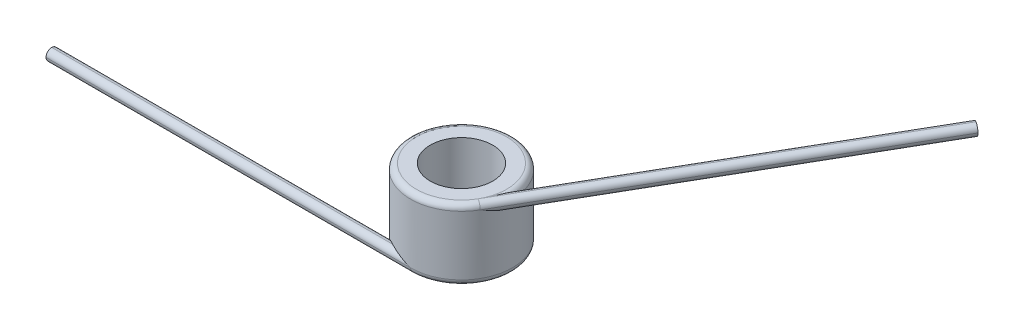
ISO-10303-21;
HEADER;
FILE_DESCRIPTION(('STEP AP214'),'2;1');
FILE_NAME('part.step','',(''),(''),'','','');
FILE_SCHEMA(('AUTOMOTIVE_DESIGN { 1 0 10303 214 1 1 1 1 }'));
ENDSEC;
DATA;
#1=APPLICATION_CONTEXT('core data for automotive mechanical design processes');
#2=APPLICATION_PROTOCOL_DEFINITION('international standard','automotive_design',2000,#1);
#3=PRODUCT_CONTEXT('',#1,'mechanical');
#4=PRODUCT('Part','Part','',(#3));
#5=PRODUCT_RELATED_PRODUCT_CATEGORY('part','',(#4));
#6=PRODUCT_DEFINITION_FORMATION('','',#4);
#7=PRODUCT_DEFINITION_CONTEXT('part definition',#1,'design');
#8=PRODUCT_DEFINITION('design','',#6,#7);
#9=PRODUCT_DEFINITION_SHAPE('','',#8);
#10=(LENGTH_UNIT() NAMED_UNIT(*) SI_UNIT(.MILLI.,.METRE.));
#11=(NAMED_UNIT(*) PLANE_ANGLE_UNIT() SI_UNIT($,.RADIAN.));
#12=(NAMED_UNIT(*) SI_UNIT($,.STERADIAN.) SOLID_ANGLE_UNIT());
#13=UNCERTAINTY_MEASURE_WITH_UNIT(LENGTH_MEASURE(1.E-05),#10,'distance_accuracy_value','');
#14=(GEOMETRIC_REPRESENTATION_CONTEXT(3) GLOBAL_UNCERTAINTY_ASSIGNED_CONTEXT((#13)) GLOBAL_UNIT_ASSIGNED_CONTEXT((#10,
#11,#12)) REPRESENTATION_CONTEXT('',''));
#15=CARTESIAN_POINT('',(0.,0.,0.));
#16=DIRECTION('',(0.,0.,1.));
#17=DIRECTION('',(1.,0.,0.));
#18=AXIS2_PLACEMENT_3D('',#15,#16,#17);
#19=CARTESIAN_POINT('',(0.,9.8806,0.));
#20=DIRECTION('',(0.,-1.,0.));
#21=DIRECTION('',(0.,0.,-1.));
#22=AXIS2_PLACEMENT_3D('',#19,#20,#21);
#23=CYLINDRICAL_SURFACE('',#22,7.112);
#24=CARTESIAN_POINT('',(0.,0.8001,0.));
#25=DIRECTION('',(0.,1.,0.));
#26=DIRECTION('',(0.,0.,1.));
#27=AXIS2_PLACEMENT_3D('',#24,#25,#26);
#28=CIRCLE('',#27,7.112);
#29=CARTESIAN_POINT('',(0.,0.8001,7.112));
#30=VERTEX_POINT('',#29);
#31=CARTESIAN_POINT('',(-4.49450828901227,0.8001,5.5118));
#32=VERTEX_POINT('',#31);
#33=EDGE_CURVE('E235',#30,#32,#28,.T.);
#34=ORIENTED_EDGE('',*,*,#33,.T.);
#35=CARTESIAN_POINT('',(-4.49450828901227,0.8001,5.5118));
#36=CARTESIAN_POINT('',(-4.49451080113085,0.816691575758345,5.51179734371992));
#37=CARTESIAN_POINT('',(-4.49387482832568,0.833272158113652,5.51231659364679));
#38=CARTESIAN_POINT('',(-4.49135592937111,0.866260241989826,5.51436941050985));
#39=CARTESIAN_POINT('',(-4.48947413973823,0.882667887428389,5.51590205296072));
#40=CARTESIAN_POINT('',(-4.48205587736146,0.931106769665993,5.5219345365684));
#41=CARTESIAN_POINT('',(-4.47474504982169,0.96271017843125,5.52787032283946));
#42=CARTESIAN_POINT('',(-4.45596264204576,1.0236437656989,5.5430210661597));
#43=CARTESIAN_POINT('',(-4.44450479750546,1.05298106519207,5.55222519596327));
#44=CARTESIAN_POINT('',(-4.41809894359944,1.10908561625661,5.57326045558614));
#45=CARTESIAN_POINT('',(-4.40314202243917,1.13584605495984,5.58509828934701));
#46=CARTESIAN_POINT('',(-4.36306513018997,1.19794411682731,5.61650291793075));
#47=CARTESIAN_POINT('',(-4.33639871034843,1.23173120947304,5.63715222757647));
#48=CARTESIAN_POINT('',(-4.27886583268416,1.29355698707431,5.6809480055889));
#49=CARTESIAN_POINT('',(-4.24799289138309,1.32158662753007,5.70409831709318));
#50=CARTESIAN_POINT('',(-4.16495159956196,1.38684666894744,5.76520996972485));
#51=CARTESIAN_POINT('',(-4.11059664917026,1.42034446454623,5.80415782657269));
#52=CARTESIAN_POINT('',(-3.99711041635319,1.4772180795716,5.8828975205468));
#53=CARTESIAN_POINT('',(-3.9379532113367,1.50053394202919,5.92269294712346));
#54=CARTESIAN_POINT('',(-3.82944843548134,1.53482372739511,5.99325753988538));
#55=CARTESIAN_POINT('',(-3.78066363030972,1.54736356568082,6.0241600987858));
#56=CARTESIAN_POINT('',(-3.68163912965761,1.56808398029715,6.08518395959253));
#57=CARTESIAN_POINT('',(-3.63139790534969,1.57625978701665,6.11530437261036));
#58=CARTESIAN_POINT('',(-3.53088358686975,1.58876244805383,6.17387384637075));
#59=CARTESIAN_POINT('',(-3.48063194389849,1.59316423705709,6.20234444486787));
#60=CARTESIAN_POINT('',(-3.37944182452965,1.59887132918416,6.25805538206685));
#61=CARTESIAN_POINT('',(-3.32850544406076,1.60018455749448,6.28529869318305));
#62=CARTESIAN_POINT('',(-3.27726446750944,1.6002,6.3119));
#63=B_SPLINE_CURVE_WITH_KNOTS('',3,(#35,#36,#37,#38,#39,#40,#41,#42,#43,#44,#45,#46,#47,#48,#49,
#50,#51,#52,#53,#54,#55,#56,#57,#58,#59,#60,#61,#62),.UNSPECIFIED.,.F.,.F.,(4,2,2,2,2,2,2,2,2,2,
2,2,2,4),(0.,0.0497337481254846,0.0994221882394215,0.197748275093918,0.295751624034279,
0.394007348529555,0.536422810542566,0.679060313182286,0.902181737986767,1.12659987042889,
1.30368265533889,1.48095858631475,1.65462723998905,1.82784977476618),.UNSPECIFIED.);
#64=CARTESIAN_POINT('',(-3.27726446750945,1.6002,6.3119));
#65=VERTEX_POINT('',#64);
#66=EDGE_CURVE('E11',#32,#65,#63,.T.);
#67=ORIENTED_EDGE('',*,*,#66,.T.);
#68=CARTESIAN_POINT('',(-3.27726446750945,1.6002,6.3119));
#69=CARTESIAN_POINT('',(-3.22577319071094,1.60019125878616,6.33863640810558));
#70=CARTESIAN_POINT('',(-3.17397080121037,1.59886105647557,6.3647320916057));
#71=CARTESIAN_POINT('',(-3.06985554330409,1.59386483641482,6.41559687844702));
#72=CARTESIAN_POINT('',(-3.01754290426367,1.59019982449484,6.44036654805308));
#73=CARTESIAN_POINT('',(-2.8601686599478,1.57618127817764,6.51254780297371));
#74=CARTESIAN_POINT('',(-2.75444607475934,1.56280151227291,6.55794815943721));
#75=CARTESIAN_POINT('',(-2.54227229890444,1.52986497624073,6.64307265846747));
#76=CARTESIAN_POINT('',(-2.43582617169205,1.5103349209512,6.68282029059783));
#77=CARTESIAN_POINT('',(-2.22200236123469,1.46640782392042,6.7569270793068));
#78=CARTESIAN_POINT('',(-2.11462408422714,1.44200742296568,6.79128248733932));
#79=CARTESIAN_POINT('',(-1.84276867346074,1.37562928115081,6.87124565452523));
#80=CARTESIAN_POINT('',(-1.67785384252937,1.33114057764134,6.9133170976154));
#81=CARTESIAN_POINT('',(-1.34713711270919,1.2362600005475,6.98530174523664));
#82=CARTESIAN_POINT('',(-1.18133498224518,1.1858665061941,7.0152116014921));
#83=CARTESIAN_POINT('',(-0.682899888290263,1.02913056514713,7.08709086236258));
#84=CARTESIAN_POINT('',(-0.349157968962726,0.91721082325161,7.11123322508794));
#85=CARTESIAN_POINT('',(-0.010660527862127,0.803675627695595,7.11199400277877));
#86=CARTESIAN_POINT('',(-0.00533018613452203,0.801887776192962,7.1119999947834));
#87=CARTESIAN_POINT('',(0.,0.8001,7.112));
#88=B_SPLINE_CURVE_WITH_KNOTS('',3,(#68,#69,#70,#71,#72,#73,#74,#75,#76,#77,#78,#79,#80,#81,#82,
#83,#84,#85,#86,#87),.UNSPECIFIED.,.F.,.F.,(4,2,2,2,2,2,2,2,2,4),(0.,0.174006957486809,
0.347939003854589,0.695046557647333,1.04066671662635,1.38652608839392,1.91360707300454,
2.4408330731805,3.49502816093425,3.51189470542901),.UNSPECIFIED.);
#89=EDGE_CURVE('E42',#65,#30,#88,.T.);
#90=ORIENTED_EDGE('',*,*,#89,.T.);
#91=EDGE_LOOP('',(#34,#67,#90));
#92=FACE_BOUND('',#91,.T.);
#93=CARTESIAN_POINT('',(0.,9.0805,0.));
#94=DIRECTION('',(0.,1.,0.));
#95=DIRECTION('',(0.,0.,1.));
#96=AXIS2_PLACEMENT_3D('',#93,#94,#95);
#97=CIRCLE('',#96,7.112);
#98=CARTESIAN_POINT('',(6.15917267171493,9.0805,3.55599999999999));
#99=VERTEX_POINT('',#98);
#100=CARTESIAN_POINT('',(7.02061296508521,9.0805,-1.13645835580435));
#101=VERTEX_POINT('',#100);
#102=EDGE_CURVE('E251',#99,#101,#97,.F.);
#103=ORIENTED_EDGE('',*,*,#102,.T.);
#104=CARTESIAN_POINT('',(7.02061296508521,9.0805,-1.13645835580435));
#105=CARTESIAN_POINT('',(7.02061192073846,9.06390842424166,-1.1364618595029));
#106=CARTESIAN_POINT('',(7.02074361796347,9.04732784188635,-1.13565146593407));
#107=CARTESIAN_POINT('',(7.0212619600389,9.01433975801018,-1.13244362701832));
#108=CARTESIAN_POINT('',(7.02164837251984,8.99793211257161,-1.13004762816623));
#109=CARTESIAN_POINT('',(7.02316352538362,8.94949323033401,-1.12060698269217));
#110=CARTESIAN_POINT('',(7.0246486533159,8.91788982156875,-1.11130772718451));
#111=CARTESIAN_POINT('',(7.02837837802948,8.85695623430111,-1.0874663132462));
#112=CARTESIAN_POINT('',(7.03062046598896,8.82761893480793,-1.07294146389991));
#113=CARTESIAN_POINT('',(7.03563460824455,8.77151438374339,-1.03955569379724));
#114=CARTESIAN_POINT('',(7.03840801242711,8.74475394504017,-1.02068370322961));
#115=CARTESIAN_POINT('',(7.04556677245244,8.68265588317269,-0.970273782145198));
#116=CARTESIAN_POINT('',(7.05011638925548,8.64886879052697,-0.936855330311583));
#117=CARTESIAN_POINT('',(7.05927820676061,8.58704301292569,-0.865132507695284));
#118=CARTESIAN_POINT('',(7.0638904939783,8.55901337246993,-0.826820600486872));
#119=CARTESIAN_POINT('',(7.07529409171401,8.49375333105256,-0.724348905890859));
#120=CARTESIAN_POINT('',(7.08184644997136,8.46025553545377,-0.657802209606287));
#121=CARTESIAN_POINT('',(7.0932939088306,8.4033819204284,-0.520150402019851));
#122=CARTESIAN_POINT('',(7.09817915669219,8.38006605797081,-0.449021046370356));
#123=CARTESIAN_POINT('',(7.10503749870404,8.34577627260489,-0.319770857666714));
#124=CARTESIAN_POINT('',(7.10740749716794,8.33323643431918,-0.262070697619209));
#125=CARTESIAN_POINT('',(7.11074346053751,8.31251601970285,-0.145801034054047));
#126=CARTESIAN_POINT('',(7.11170789122948,8.30434021298335,-0.0872306509772452));
#127=CARTESIAN_POINT('',(7.11217338415229,8.29183755194617,0.0291020391506583));
#128=CARTESIAN_POINT('',(7.11170382422612,8.28743576294291,0.0868565377942412));
#129=CARTESIAN_POINT('',(7.10935585142464,8.28172867081584,0.202345220379128));
#130=CARTESIAN_POINT('',(7.10748106070003,8.28041544250552,0.260079075400112));
#131=CARTESIAN_POINT('',(7.10489797990172,8.2804,0.317755716216755));
#132=B_SPLINE_CURVE_WITH_KNOTS('',3,(#104,#105,#106,#107,#108,#109,#110,#111,#112,#113,#114,
#115,#116,#117,#118,#119,#120,#121,#122,#123,#124,#125,#126,#127,#128,#129,#130,#131),
.UNSPECIFIED.,.F.,.F.,(4,2,2,2,2,2,2,2,2,2,2,2,2,4),(0.,0.0497337481254836,0.0994221882394212,
0.197748275093917,0.295751624034276,0.394007348529553,0.536422810542564,0.679060313182285,
0.902181737986767,1.12659987042889,1.30368265533889,1.48095858631475,1.65462723998906,
1.82784977476619),.UNSPECIFIED.);
#133=CARTESIAN_POINT('',(7.10489797990172,8.2804,0.317755716216726));
#134=VERTEX_POINT('',#133);
#135=EDGE_CURVE('E56',#101,#134,#132,.T.);
#136=ORIENTED_EDGE('',*,*,#135,.T.);
#137=CARTESIAN_POINT('',(7.10489797990172,8.2804,0.317755716216726));
#138=CARTESIAN_POINT('',(7.10230675012785,8.28040874121383,0.375716674050309));
#139=CARTESIAN_POINT('',(7.09900508021779,8.28173894352443,0.433626701084578));
#140=CARTESIAN_POINT('',(7.09099764882732,8.28673516358517,0.549225552773618));
#141=CARTESIAN_POINT('',(7.0862924924293,8.29040017550516,0.60691446192464));
#142=CARTESIAN_POINT('',(7.07011617070968,8.30441872182235,0.779295182863842));
#143=CARTESIAN_POINT('',(7.05657274015372,8.31779848772708,0.893553805622536));
#144=CARTESIAN_POINT('',(7.0242058308709,8.35073502375925,1.11986393504488));
#145=CARTESIAN_POINT('',(7.00540522642987,8.37026507904878,1.23192280141049));
#146=CARTESIAN_POINT('',(6.96267168281604,8.41419217607957,1.4541530475551));
#147=CARTESIAN_POINT('',(6.9387352004258,8.43859257703432,1.56432306727452));
#148=CARTESIAN_POINT('',(6.87205762919265,8.50497071884918,1.83973834274747));
#149=CARTESIAN_POINT('',(6.82603515221691,8.54945942235861,2.00359449733995));
#150=CARTESIAN_POINT('',(6.7230173208293,8.64433999945256,2.32599591063135));
#151=CARTESIAN_POINT('',(6.66601895093809,8.69473349380609,2.48453969574246));
#152=CARTESIAN_POINT('',(6.47905066987962,8.85146943485252,2.9521367796805));
#153=CARTESIAN_POINT('',(6.33308760964313,8.96338917674642,3.25323694148906));
#154=CARTESIAN_POINT('',(6.16449774190005,9.07692437230435,3.54676471344305));
#155=CARTESIAN_POINT('',(6.16183776026449,9.07871222380701,3.55138392079231));
#156=CARTESIAN_POINT('',(6.15917267171494,9.0805,3.55599999999999));
#157=B_SPLINE_CURVE_WITH_KNOTS('',3,(#137,#138,#139,#140,#141,#142,#143,#144,#145,#146,#147,
#148,#149,#150,#151,#152,#153,#154,#155,#156),.UNSPECIFIED.,.F.,.F.,(4,2,2,2,2,2,2,2,2,4),(0.,
0.174006957486763,0.347939003854497,0.695046557647168,1.04066671662628,1.38652608839392,
1.91360707300456,2.44083307318056,3.49502816093425,3.51189470542901),.UNSPECIFIED.);
#158=EDGE_CURVE('E198',#134,#99,#157,.T.);
#159=ORIENTED_EDGE('',*,*,#158,.T.);
#160=EDGE_LOOP('',(#103,#136,#159));
#161=FACE_BOUND('',#160,.T.);
#162=ADVANCED_FACE('F32',(#92,#161),#23,.T.);
#163=CARTESIAN_POINT('',(0.,9.8806,0.));
#164=DIRECTION('',(0.,1.,0.));
#165=DIRECTION('',(0.,0.,1.));
#166=AXIS2_PLACEMENT_3D('',#163,#164,#165);
#167=PLANE('',#166);
#168=CARTESIAN_POINT('',(0.,9.8806,0.));
#169=DIRECTION('',(0.,1.,0.));
#170=DIRECTION('',(0.,0.,1.));
#171=AXIS2_PLACEMENT_3D('',#168,#169,#170);
#172=CIRCLE('',#171,6.3119);
#173=CARTESIAN_POINT('',(5.46626779756084,9.8806,3.15594644684433));
#174=VERTEX_POINT('',#173);
#175=EDGE_CURVE('E231',#174,#174,#172,.T.);
#176=ORIENTED_EDGE('',*,*,#175,.T.);
#177=EDGE_LOOP('',(#176));
#178=FACE_BOUND('',#177,.T.);
#179=CARTESIAN_POINT('',(0.,9.8806,0.));
#180=DIRECTION('',(0.,1.,0.));
#181=DIRECTION('',(0.,0.,1.));
#182=AXIS2_PLACEMENT_3D('',#179,#180,#181);
#183=CIRCLE('',#182,4.3561);
#184=CARTESIAN_POINT('',(0.,9.8806,4.3561));
#185=VERTEX_POINT('',#184);
#186=EDGE_CURVE('E256',#185,#185,#183,.T.);
#187=ORIENTED_EDGE('',*,*,#186,.F.);
#188=EDGE_LOOP('',(#187));
#189=FACE_BOUND('',#188,.T.);
#190=ADVANCED_FACE('F192',(#178,#189),#167,.T.);
#191=CARTESIAN_POINT('',(0.,0.,0.));
#192=DIRECTION('',(0.,1.,0.));
#193=DIRECTION('',(0.,0.,1.));
#194=AXIS2_PLACEMENT_3D('',#191,#192,#193);
#195=PLANE('',#194);
#196=CARTESIAN_POINT('',(0.,0.,0.));
#197=DIRECTION('',(0.,1.,0.));
#198=DIRECTION('',(0.,0.,1.));
#199=AXIS2_PLACEMENT_3D('',#196,#197,#198);
#200=CIRCLE('',#199,6.3119);
#201=CARTESIAN_POINT('',(-4.11568839592003E-06,0.,6.31189999999866));
#202=VERTEX_POINT('',#201);
#203=EDGE_CURVE('E206',#202,#202,#200,.F.);
#204=ORIENTED_EDGE('',*,*,#203,.T.);
#205=EDGE_LOOP('',(#204));
#206=FACE_BOUND('',#205,.T.);
#207=CARTESIAN_POINT('',(0.,0.,0.));
#208=DIRECTION('',(0.,1.,0.));
#209=DIRECTION('',(0.,0.,1.));
#210=AXIS2_PLACEMENT_3D('',#207,#208,#209);
#211=CIRCLE('',#210,4.3561);
#212=CARTESIAN_POINT('',(0.,0.,4.3561));
#213=VERTEX_POINT('',#212);
#214=EDGE_CURVE('E257',#213,#213,#211,.T.);
#215=ORIENTED_EDGE('',*,*,#214,.T.);
#216=EDGE_LOOP('',(#215));
#217=FACE_BOUND('',#216,.T.);
#218=ADVANCED_FACE('F193',(#206,#217),#195,.F.);
#219=CARTESIAN_POINT('',(0.,9.8806,0.));
#220=DIRECTION('',(0.,-1.,0.));
#221=DIRECTION('',(0.,0.,-1.));
#222=AXIS2_PLACEMENT_3D('',#219,#220,#221);
#223=CYLINDRICAL_SURFACE('',#222,4.3561);
#224=ORIENTED_EDGE('',*,*,#186,.T.);
#225=EDGE_LOOP('',(#224));
#226=FACE_BOUND('',#225,.T.);
#227=ORIENTED_EDGE('',*,*,#214,.F.);
#228=EDGE_LOOP('',(#227));
#229=FACE_BOUND('',#228,.T.);
#230=ADVANCED_FACE('F263',(#226,#229),#223,.F.);
#231=CARTESIAN_POINT('',(-50.8,1.6002,0.));
#232=DIRECTION('',(1.,0.,0.));
#233=DIRECTION('',(0.,0.,-1.));
#234=AXIS2_PLACEMENT_3D('',#231,#232,#233);
#235=PLANE('',#234);
#236=CARTESIAN_POINT('',(-50.8,0.8001,6.31190000000001));
#237=DIRECTION('',(1.,0.,0.));
#238=DIRECTION('',(0.,0.,-1.));
#239=AXIS2_PLACEMENT_3D('',#236,#237,#238);
#240=CIRCLE('',#239,0.8001);
#241=CARTESIAN_POINT('',(-50.8,0.8001,5.51180000000001));
#242=VERTEX_POINT('',#241);
#243=CARTESIAN_POINT('',(-50.8,0.,6.31190000000001));
#244=VERTEX_POINT('',#243);
#245=EDGE_CURVE('E127',#242,#244,#240,.F.);
#246=ORIENTED_EDGE('',*,*,#245,.T.);
#247=CARTESIAN_POINT('',(-50.8,0.8001,6.31190000000001));
#248=DIRECTION('',(1.,0.,0.));
#249=DIRECTION('',(0.,0.,-1.));
#250=AXIS2_PLACEMENT_3D('',#247,#248,#249);
#251=CIRCLE('',#250,0.8001);
#252=CARTESIAN_POINT('',(-50.8,0.8001,7.11200000000001));
#253=VERTEX_POINT('',#252);
#254=EDGE_CURVE('E225',#244,#253,#251,.F.);
#255=ORIENTED_EDGE('',*,*,#254,.T.);
#256=CARTESIAN_POINT('',(-50.8,0.8001,6.31190000000001));
#257=DIRECTION('',(1.,0.,0.));
#258=DIRECTION('',(0.,0.,-1.));
#259=AXIS2_PLACEMENT_3D('',#256,#257,#258);
#260=CIRCLE('',#259,0.8001);
#261=CARTESIAN_POINT('',(-50.8,1.6002,6.31190000000001));
#262=VERTEX_POINT('',#261);
#263=EDGE_CURVE('E232',#253,#262,#260,.F.);
#264=ORIENTED_EDGE('',*,*,#263,.T.);
#265=CARTESIAN_POINT('',(-50.8,0.8001,6.31190000000001));
#266=DIRECTION('',(1.,0.,0.));
#267=DIRECTION('',(0.,0.,-1.));
#268=AXIS2_PLACEMENT_3D('',#265,#266,#267);
#269=CIRCLE('',#268,0.8001);
#270=EDGE_CURVE('E125',#262,#242,#269,.F.);
#271=ORIENTED_EDGE('',*,*,#270,.T.);
#272=EDGE_LOOP('',(#246,#255,#264,#271));
#273=FACE_BOUND('',#272,.T.);
#274=ADVANCED_FACE('F242',(#273),#235,.F.);
#275=CARTESIAN_POINT('',(25.3999999999999,8.2804,-43.9940905122495));
#276=DIRECTION('',(-0.499999999999999,0.,0.866025403784439));
#277=DIRECTION('',(0.866025403784439,0.,0.499999999999999));
#278=AXIS2_PLACEMENT_3D('',#275,#276,#277);
#279=PLANE('',#278);
#280=CARTESIAN_POINT('',(30.8662657461469,9.0805,-40.8381405122495));
#281=DIRECTION('',(-0.499999999999999,0.,0.866025403784439));
#282=DIRECTION('',(0.866025403784439,0.,0.499999999999999));
#283=AXIS2_PLACEMENT_3D('',#280,#281,#282);
#284=CIRCLE('',#283,0.8001);
#285=CARTESIAN_POINT('',(30.173358820579,9.0805,-41.2381905122495));
#286=VERTEX_POINT('',#285);
#287=CARTESIAN_POINT('',(30.8662657461469,9.8806,-40.8381405122495));
#288=VERTEX_POINT('',#287);
#289=EDGE_CURVE('E100',#286,#288,#284,.F.);
#290=ORIENTED_EDGE('',*,*,#289,.T.);
#291=CARTESIAN_POINT('',(30.8662657461469,9.0805,-40.8381405122495));
#292=DIRECTION('',(-0.499999999999999,0.,0.866025403784439));
#293=DIRECTION('',(0.866025403784439,0.,0.499999999999999));
#294=AXIS2_PLACEMENT_3D('',#291,#292,#293);
#295=CIRCLE('',#294,0.8001);
#296=CARTESIAN_POINT('',(31.5591726717149,9.0805,-40.4380905122495));
#297=VERTEX_POINT('',#296);
#298=EDGE_CURVE('E104',#288,#297,#295,.F.);
#299=ORIENTED_EDGE('',*,*,#298,.T.);
#300=CARTESIAN_POINT('',(30.8662657461469,9.0805,-40.8381405122495));
#301=DIRECTION('',(-0.499999999999999,0.,0.866025403784439));
#302=DIRECTION('',(0.866025403784439,0.,0.499999999999999));
#303=AXIS2_PLACEMENT_3D('',#300,#301,#302);
#304=CIRCLE('',#303,0.8001);
#305=CARTESIAN_POINT('',(30.8662657461469,8.2804,-40.8381405122495));
#306=VERTEX_POINT('',#305);
#307=EDGE_CURVE('E110',#297,#306,#304,.F.);
#308=ORIENTED_EDGE('',*,*,#307,.T.);
#309=CARTESIAN_POINT('',(30.8662657461469,9.0805,-40.8381405122495));
#310=DIRECTION('',(-0.499999999999999,0.,0.866025403784439));
#311=DIRECTION('',(0.866025403784439,0.,0.499999999999999));
#312=AXIS2_PLACEMENT_3D('',#309,#310,#311);
#313=CIRCLE('',#312,0.8001);
#314=EDGE_CURVE('E106',#306,#286,#313,.F.);
#315=ORIENTED_EDGE('',*,*,#314,.T.);
#316=EDGE_LOOP('',(#290,#299,#308,#315));
#317=FACE_BOUND('',#316,.T.);
#318=ADVANCED_FACE('F102',(#317),#279,.F.);
#319=CARTESIAN_POINT('',(5.46626574614702,9.0805,3.15595));
#320=DIRECTION('',(0.499999999999998,0.,-0.86602540378444));
#321=DIRECTION('',(-0.86602540378444,0.,-0.499999999999998));
#322=AXIS2_PLACEMENT_3D('',#319,#320,#321);
#323=CYLINDRICAL_SURFACE('',#322,0.8001);
#324=DIRECTION('',(0.499999999999998,0.,-0.86602540378444));
#325=VECTOR('',#324,1.);
#326=CARTESIAN_POINT('',(4.77335882057909,9.0805,2.7559));
#327=LINE('',#326,#325);
#328=EDGE_CURVE('E132',#286,#101,#327,.F.);
#329=ORIENTED_EDGE('',*,*,#328,.F.);
#330=ORIENTED_EDGE('',*,*,#314,.F.);
#331=DIRECTION('',(0.499999999999998,0.,-0.86602540378444));
#332=VECTOR('',#331,1.);
#333=CARTESIAN_POINT('',(5.46626574614702,8.2804,3.15595));
#334=LINE('',#333,#332);
#335=EDGE_CURVE('E393',#134,#306,#334,.T.);
#336=ORIENTED_EDGE('',*,*,#335,.F.);
#337=ORIENTED_EDGE('',*,*,#135,.F.);
#338=EDGE_LOOP('',(#329,#330,#336,#337));
#339=FACE_BOUND('',#338,.T.);
#340=ADVANCED_FACE('F215',(#339),#323,.T.);
#341=CARTESIAN_POINT('',(5.46626574614702,9.0805,3.15595));
#342=DIRECTION('',(-0.499999999999998,0.,0.86602540378444));
#343=DIRECTION('',(0.86602540378444,0.,0.499999999999998));
#344=AXIS2_PLACEMENT_3D('',#341,#342,#343);
#345=CYLINDRICAL_SURFACE('',#344,0.8001);
#346=ORIENTED_EDGE('',*,*,#289,.F.);
#347=ORIENTED_EDGE('',*,*,#328,.T.);
#348=CARTESIAN_POINT('',(5.46626676012167,9.8806,3.15594824330743));
#349=CARTESIAN_POINT('',(5.48499261442351,9.88059969857894,3.12351414911172));
#350=CARTESIAN_POINT('',(5.50357410947956,9.88059994909433,3.09099667308289));
#351=CARTESIAN_POINT('',(5.54785580872241,9.88059969611951,3.01269731482231));
#352=CARTESIAN_POINT('',(5.5734160322333,9.88059884917433,2.96683621454294));
#353=CARTESIAN_POINT('',(5.62747615510946,9.88059019239127,2.86840132096153));
#354=CARTESIAN_POINT('',(5.65589075719437,9.88058143097318,2.81578063714886));
#355=CARTESIAN_POINT('',(5.70460647812475,9.8805443601178,2.7240137548599));
#356=CARTESIAN_POINT('',(5.72507861374692,9.88052178869238,2.68495812182852));
#357=CARTESIAN_POINT('',(5.7858800895172,9.88042047360744,2.56747592735));
#358=CARTESIAN_POINT('',(5.8255963803522,9.88030813012375,2.48873061339137));
#359=CARTESIAN_POINT('',(5.90340362598588,9.87988949483635,2.33038475923582));
#360=CARTESIAN_POINT('',(5.94149357513751,9.87958308483386,2.25078372691798));
#361=CARTESIAN_POINT('',(6.05375478534055,9.87816832177876,2.00979109787913));
#362=CARTESIAN_POINT('',(6.12539815274982,9.87656206619228,1.8472134019341));
#363=CARTESIAN_POINT('',(6.26194131545819,9.87042129651036,1.51922431480281));
#364=CARTESIAN_POINT('',(6.32683813664789,9.86588549727316,1.35381171100626));
#365=CARTESIAN_POINT('',(6.44971816648998,9.85157372868502,1.02097560635688));
#366=CARTESIAN_POINT('',(6.5077144709652,9.84180788524813,0.853556600408431));
#367=CARTESIAN_POINT('',(6.58956449725003,9.82065593082386,0.601372149431789));
#368=CARTESIAN_POINT('',(6.61598266993065,9.81252511873399,0.517162262337543));
#369=CARTESIAN_POINT('',(6.6670990444515,9.79347859818166,0.348540895993368));
#370=CARTESIAN_POINT('',(6.69179752064076,9.7825633352339,0.264129451131257));
#371=CARTESIAN_POINT('',(6.7371367708898,9.75839316768157,0.103545766088785));
#372=CARTESIAN_POINT('',(6.75793859588382,9.74546886463829,0.0273702959354831));
#373=CARTESIAN_POINT('',(6.79811427387748,9.71587432434257,-0.12474784045139));
#374=CARTESIAN_POINT('',(6.81748620802691,9.69919917077842,-0.200690067333723));
#375=CARTESIAN_POINT('',(6.85589282521772,9.65974714780208,-0.356554212193183));
#376=CARTESIAN_POINT('',(6.87482865619374,9.63665102292511,-0.436423988994612));
#377=CARTESIAN_POINT('',(6.9017844161694,9.59617158899269,-0.55446726087765));
#378=CARTESIAN_POINT('',(6.91052010903806,9.58172372172607,-0.593482292948187));
#379=CARTESIAN_POINT('',(6.9274711865529,9.55042787084753,-0.670644810543019));
#380=CARTESIAN_POINT('',(6.93568687778782,9.53358132088431,-0.708792798603019));
#381=CARTESIAN_POINT('',(6.94985877843608,9.50073586373197,-0.775852360139668));
#382=CARTESIAN_POINT('',(6.95592641429695,9.48530580996148,-0.805016969410414));
#383=CARTESIAN_POINT('',(6.96764132832719,9.45210333992884,-0.862158553154659));
#384=CARTESIAN_POINT('',(6.97328792963066,9.43432727402159,-0.890133585481847));
#385=CARTESIAN_POINT('',(6.98408982291726,9.3957099130944,-0.944406373226959));
#386=CARTESIAN_POINT('',(6.98924025191622,9.37484254579157,-0.97068682665824));
#387=CARTESIAN_POINT('',(6.99878511521485,9.32939305170003,-1.0200227426777));
#388=CARTESIAN_POINT('',(7.00318158417886,9.30482127004597,-1.04308685250754));
#389=CARTESIAN_POINT('',(7.00910133885234,9.26336116498778,-1.07445813257579));
#390=CARTESIAN_POINT('',(7.01102482034372,9.24802355061421,-1.08472187320071));
#391=CARTESIAN_POINT('',(7.0144246127578,9.21604211081893,-1.1029466659978));
#392=CARTESIAN_POINT('',(7.01590273512352,9.19940393314707,-1.11091704002625));
#393=CARTESIAN_POINT('',(7.01822332068747,9.16607884608238,-1.12346593494527));
#394=CARTESIAN_POINT('',(7.01910131079207,9.14946769057526,-1.1282336634696));
#395=CARTESIAN_POINT('',(7.02030433554238,9.1154340690559,-1.13477687324144));
#396=CARTESIAN_POINT('',(7.0206220555862,9.09800387794656,-1.13651276967413));
#397=CARTESIAN_POINT('',(7.02061296508521,9.0805,-1.13645835580435));
#398=B_SPLINE_CURVE_WITH_KNOTS('',3,(#348,#349,#350,#351,#352,#353,#354,#355,#356,#357,#358,
#359,#360,#361,#362,#363,#364,#365,#366,#367,#368,#369,#370,#371,#372,#373,#374,#375,#376,#377,
#378,#379,#380,#381,#382,#383,#384,#385,#386,#387,#388,#389,#390,#391,#392,#393,#394,#395,#396,
#397),.UNSPECIFIED.,.F.,.F.,(4,2,2,2,2,2,2,2,2,2,2,2,2,2,2,2,2,2,2,2,2,2,2,2,4),(0.,
0.112354769438682,0.269859741786549,0.449260292393991,0.581546354651303,0.84610667310258,
1.11082828066542,1.64365834576439,2.17672231340307,2.70875792480953,2.97460269072482,
3.24040494788383,3.48036748831549,3.72064640420339,3.97612488339164,4.10360260457239,
4.23100445200967,4.33157174456418,4.43229737362338,4.5339267850404,4.63527746567018,
4.69079310259855,4.74607978982689,4.79771603676915,4.85002156396069),.UNSPECIFIED.);
#399=EDGE_CURVE('E117',#174,#101,#398,.T.);
#400=ORIENTED_EDGE('',*,*,#399,.F.);
#401=DIRECTION('',(0.499999999999998,0.,-0.86602540378444));
#402=VECTOR('',#401,1.);
#403=CARTESIAN_POINT('',(7.71351989065314,9.8806,-0.73640835580435));
#404=LINE('',#403,#402);
#405=EDGE_CURVE('E114',#288,#174,#404,.F.);
#406=ORIENTED_EDGE('',*,*,#405,.F.);
#407=EDGE_LOOP('',(#346,#347,#400,#406));
#408=FACE_BOUND('',#407,.T.);
#409=ADVANCED_FACE('F115',(#408),#345,.T.);
#410=CARTESIAN_POINT('',(5.46626574614701,9.0805,3.15594999999999));
#411=DIRECTION('',(-0.499999999999998,0.,0.86602540378444));
#412=DIRECTION('',(0.86602540378444,0.,0.499999999999998));
#413=AXIS2_PLACEMENT_3D('',#410,#411,#412);
#414=CYLINDRICAL_SURFACE('',#413,0.8001);
#415=ORIENTED_EDGE('',*,*,#335,.T.);
#416=ORIENTED_EDGE('',*,*,#307,.F.);
#417=DIRECTION('',(-0.499999999999998,0.,0.86602540378444));
#418=VECTOR('',#417,1.);
#419=CARTESIAN_POINT('',(6.15917267171494,9.0805,3.55599999999999));
#420=LINE('',#419,#418);
#421=EDGE_CURVE('E120',#99,#297,#420,.F.);
#422=ORIENTED_EDGE('',*,*,#421,.F.);
#423=ORIENTED_EDGE('',*,*,#158,.F.);
#424=EDGE_LOOP('',(#415,#416,#422,#423));
#425=FACE_BOUND('',#424,.T.);
#426=ADVANCED_FACE('F208',(#425),#414,.T.);
#427=CARTESIAN_POINT('',(0.,9.0805,0.));
#428=DIRECTION('',(0.,1.,0.));
#429=DIRECTION('',(0.,0.,1.));
#430=AXIS2_PLACEMENT_3D('',#427,#428,#429);
#431=TOROIDAL_SURFACE('',#430,6.3119,0.8001);
#432=ORIENTED_EDGE('',*,*,#399,.T.);
#433=ORIENTED_EDGE('',*,*,#102,.F.);
#434=CARTESIAN_POINT('',(5.466265746147,9.0805,3.15594999999999));
#435=DIRECTION('',(0.499999999999999,0.,-0.86602540378444));
#436=DIRECTION('',(-0.86602540378444,0.,-0.499999999999999));
#437=AXIS2_PLACEMENT_3D('',#434,#435,#436);
#438=CIRCLE('',#437,0.8001);
#439=EDGE_CURVE('E383',#174,#99,#438,.T.);
#440=ORIENTED_EDGE('',*,*,#439,.F.);
#441=ORIENTED_EDGE('',*,*,#175,.F.);
#442=EDGE_LOOP('',(#432,#433,#440,#441));
#443=FACE_BOUND('',#442,.T.);
#444=ADVANCED_FACE('F212',(#443),#431,.T.);
#445=CARTESIAN_POINT('',(5.46626574614701,9.0805,3.15594999999999));
#446=DIRECTION('',(0.499999999999998,0.,-0.86602540378444));
#447=DIRECTION('',(-0.86602540378444,0.,-0.499999999999998));
#448=AXIS2_PLACEMENT_3D('',#445,#446,#447);
#449=CYLINDRICAL_SURFACE('',#448,0.8001);
#450=ORIENTED_EDGE('',*,*,#298,.F.);
#451=ORIENTED_EDGE('',*,*,#405,.T.);
#452=ORIENTED_EDGE('',*,*,#439,.T.);
#453=ORIENTED_EDGE('',*,*,#421,.T.);
#454=EDGE_LOOP('',(#450,#451,#452,#453));
#455=FACE_BOUND('',#454,.T.);
#456=ADVANCED_FACE('F122',(#455),#449,.T.);
#457=CARTESIAN_POINT('',(0.,0.8001,6.3119));
#458=DIRECTION('',(1.,0.,0.));
#459=DIRECTION('',(0.,0.,-1.));
#460=AXIS2_PLACEMENT_3D('',#457,#458,#459);
#461=CYLINDRICAL_SURFACE('',#460,0.8001);
#462=DIRECTION('',(-1.,0.,0.));
#463=VECTOR('',#462,1.);
#464=CARTESIAN_POINT('',(-4.49450828901227,0.8001,5.5118));
#465=LINE('',#464,#463);
#466=EDGE_CURVE('E239',#242,#32,#465,.F.);
#467=ORIENTED_EDGE('',*,*,#466,.F.);
#468=ORIENTED_EDGE('',*,*,#270,.F.);
#469=DIRECTION('',(-1.,0.,0.));
#470=VECTOR('',#469,1.);
#471=CARTESIAN_POINT('',(-50.8,1.6002,6.31190000000001));
#472=LINE('',#471,#470);
#473=EDGE_CURVE('E156',#65,#262,#472,.T.);
#474=ORIENTED_EDGE('',*,*,#473,.F.);
#475=ORIENTED_EDGE('',*,*,#66,.F.);
#476=EDGE_LOOP('',(#467,#468,#474,#475));
#477=FACE_BOUND('',#476,.T.);
#478=ADVANCED_FACE('F34',(#477),#461,.T.);
#479=CARTESIAN_POINT('',(0.,0.8001,6.3119));
#480=DIRECTION('',(-1.,0.,0.));
#481=DIRECTION('',(0.,0.,1.));
#482=AXIS2_PLACEMENT_3D('',#479,#480,#481);
#483=CYLINDRICAL_SURFACE('',#482,0.8001);
#484=ORIENTED_EDGE('',*,*,#245,.F.);
#485=ORIENTED_EDGE('',*,*,#466,.T.);
#486=CARTESIAN_POINT('',(0.,0.,6.3119));
#487=CARTESIAN_POINT('',(-0.0374523527848872,3.01436874134972E-07,6.31190002432631));
#488=CARTESIAN_POINT('',(-0.0749047367558599,5.09058655638664E-08,6.31173333300694));
#489=CARTESIAN_POINT('',(-0.164855495814474,3.03877549540893E-07,6.31093272425839));
#490=CARTESIAN_POINT('',(-0.217352485455457,1.15082484327572E-06,6.31013797703391));
#491=CARTESIAN_POINT('',(-0.329629665352234,9.80760967251414E-06,6.30773797000944));
#492=CARTESIAN_POINT('',(-0.38940781534158,1.85690270420323E-05,6.30603539533736));
#493=CARTESIAN_POINT('',(-0.49323812709543,5.56398820351588E-05,6.30234100607705));
#494=CARTESIAN_POINT('',(-0.537297365272478,7.82113075641526E-05,6.30054257908132));
#495=CARTESIAN_POINT('',(-0.6694406680681,0.000179526392677867,6.29445710444903));
#496=CARTESIAN_POINT('',(-0.757494255802707,0.000291869876276071,6.28947976427581));
#497=CARTESIAN_POINT('',(-0.933529410902271,0.000710505163613676,6.27768988851446));
#498=CARTESIAN_POINT('',(-1.02151090163292,0.00101691516612853,6.27087623594997));
#499=CARTESIAN_POINT('',(-1.28634724560709,0.00243167822126274,6.24760098132639));
#500=CARTESIAN_POINT('',(-1.462965344089,0.00403793380773094,6.22835710954274));
#501=CARTESIAN_POINT('',(-1.81528380706323,0.0101787034896404,6.18261241359541));
#502=CARTESIAN_POINT('',(-1.99098373465217,0.0147145027268537,6.1561084074723));
#503=CARTESIAN_POINT('',(-2.34066827149628,0.0290262713150128,6.09610758260866));
#504=CARTESIAN_POINT('',(-2.51465553596149,0.0387921147519019,6.06262435263559));
#505=CARTESIAN_POINT('',(-2.77397869008896,0.059944069176165,6.00741632921038));
#506=CARTESIAN_POINT('',(-2.86011567790265,0.0680748812660384,5.98819019432624));
#507=CARTESIAN_POINT('',(-3.03170425203786,0.0871214018183537,5.94814759003859));
#508=CARTESIAN_POINT('',(-3.11715594575317,0.0980366647661083,5.92733137542221));
#509=CARTESIAN_POINT('',(-3.27889512155773,0.122206832318435,5.88630447540521));
#510=CARTESIAN_POINT('',(-3.35526592635271,0.135131135361716,5.86623164921845));
#511=CARTESIAN_POINT('',(-3.50709193583692,0.164725675657438,5.82496573878179));
#512=CARTESIAN_POINT('',(-3.5825458006117,0.18140082922158,5.80377121243448));
#513=CARTESIAN_POINT('',(-3.73673141819454,0.220852852197928,5.75910024616541));
#514=CARTESIAN_POINT('',(-3.81536858938719,0.2439489770749,5.73556426843169));
#515=CARTESIAN_POINT('',(-3.93107494157156,0.284428411007327,5.69988700540741));
#516=CARTESIAN_POINT('',(-3.96923079690844,0.298876278273942,5.68794482131606));
#517=CARTESIAN_POINT('',(-4.04453103612294,0.330172129152482,5.66404362626802));
#518=CARTESIAN_POINT('',(-4.08167600850363,0.347018679115703,5.65208462955711));
#519=CARTESIAN_POINT('',(-4.14683724268514,0.379864136268041,5.63082807477009));
#520=CARTESIAN_POINT('',(-4.17512835313548,0.395294190038537,5.62150049693114));
#521=CARTESIAN_POINT('',(-4.23047187328559,0.428496660071173,5.60307511821235));
#522=CARTESIAN_POINT('',(-4.25752226260436,0.446272725978421,5.59397770222261));
#523=CARTESIAN_POINT('',(-4.30992482216913,0.484890086905612,5.57619602234522));
#524=CARTESIAN_POINT('',(-4.33525957696307,0.505757454208445,5.56751619798306));
#525=CARTESIAN_POINT('',(-4.38275816520421,0.551206948299987,5.5511143340656));
#526=CARTESIAN_POINT('',(-4.40493050471453,0.575778729954043,5.54338973296047));
#527=CARTESIAN_POINT('',(-4.43505870753961,0.617238835012236,5.53283075085775));
#528=CARTESIAN_POINT('',(-4.44490910840433,0.632576449385801,5.52936466438053));
#529=CARTESIAN_POINT('',(-4.46239213815236,0.664557889181088,5.52319657458017));
#530=CARTESIAN_POINT('',(-4.47003374572151,0.681196066852945,5.52049147908457));
#531=CARTESIAN_POINT('',(-4.48206170029278,0.714521153917634,5.51622671767509));
#532=CARTESIAN_POINT('',(-4.4866296693655,0.731132309424755,5.51460321514778));
#533=CARTESIAN_POINT('',(-4.49289776762536,0.765165930944103,5.51237346025701));
#534=CARTESIAN_POINT('',(-4.49455995805631,0.782596122053444,5.51178066566991));
#535=CARTESIAN_POINT('',(-4.49450828901227,0.8001,5.5118));
#536=B_SPLINE_CURVE_WITH_KNOTS('',3,(#486,#487,#488,#489,#490,#491,#492,#493,#494,#495,#496,
#497,#498,#499,#500,#501,#502,#503,#504,#505,#506,#507,#508,#509,#510,#511,#512,#513,#514,#515,
#516,#517,#518,#519,#520,#521,#522,#523,#524,#525,#526,#527,#528,#529,#530,#531,#532,#533,#534,
#535),.UNSPECIFIED.,.F.,.F.,(4,2,2,2,2,2,2,2,2,2,2,2,2,2,2,2,2,2,2,2,2,2,2,2,4),(0.,
0.112356797747285,0.269861770095055,0.449262320702424,0.581548382959748,0.846108701410669,
1.11083030897391,1.64366037407323,2.17672434171237,2.70875995311854,2.97460471903366,
3.2404069761925,3.48036951662413,3.72064843251205,3.9761269117003,4.10360463288105,
4.23100648031833,4.33157377287284,4.43229940193203,4.53392881334904,4.63527949397882,
4.69079513090718,4.74608181813553,4.79771806507778,4.85002359226932),.UNSPECIFIED.);
#537=EDGE_CURVE('E145',#202,#32,#536,.T.);
#538=ORIENTED_EDGE('',*,*,#537,.F.);
#539=DIRECTION('',(-1.,0.,0.));
#540=VECTOR('',#539,1.);
#541=CARTESIAN_POINT('',(0.,0.,6.3119));
#542=LINE('',#541,#540);
#543=EDGE_CURVE('E142',#244,#202,#542,.F.);
#544=ORIENTED_EDGE('',*,*,#543,.F.);
#545=EDGE_LOOP('',(#484,#485,#538,#544));
#546=FACE_BOUND('',#545,.T.);
#547=ADVANCED_FACE('F158',(#546),#483,.T.);
#548=CARTESIAN_POINT('',(0.,0.8001,6.3119));
#549=DIRECTION('',(-1.,0.,0.));
#550=DIRECTION('',(0.,0.,1.));
#551=AXIS2_PLACEMENT_3D('',#548,#549,#550);
#552=CYLINDRICAL_SURFACE('',#551,0.8001);
#553=ORIENTED_EDGE('',*,*,#473,.T.);
#554=ORIENTED_EDGE('',*,*,#263,.F.);
#555=DIRECTION('',(1.,0.,0.));
#556=VECTOR('',#555,1.);
#557=CARTESIAN_POINT('',(-50.8,0.8001,7.11200000000001));
#558=LINE('',#557,#556);
#559=EDGE_CURVE('E140',#30,#253,#558,.F.);
#560=ORIENTED_EDGE('',*,*,#559,.F.);
#561=ORIENTED_EDGE('',*,*,#89,.F.);
#562=EDGE_LOOP('',(#553,#554,#560,#561));
#563=FACE_BOUND('',#562,.T.);
#564=ADVANCED_FACE('F165',(#563),#552,.T.);
#565=CARTESIAN_POINT('',(0.,0.8001,0.));
#566=DIRECTION('',(0.,1.,0.));
#567=DIRECTION('',(0.,0.,1.));
#568=AXIS2_PLACEMENT_3D('',#565,#566,#567);
#569=TOROIDAL_SURFACE('',#568,6.3119,0.8001);
#570=ORIENTED_EDGE('',*,*,#537,.T.);
#571=ORIENTED_EDGE('',*,*,#33,.F.);
#572=CARTESIAN_POINT('',(0.,0.8001,6.3119));
#573=DIRECTION('',(-1.,0.,0.));
#574=DIRECTION('',(0.,0.,1.));
#575=AXIS2_PLACEMENT_3D('',#572,#573,#574);
#576=CIRCLE('',#575,0.8001);
#577=EDGE_CURVE('E138',#202,#30,#576,.T.);
#578=ORIENTED_EDGE('',*,*,#577,.F.);
#579=ORIENTED_EDGE('',*,*,#203,.F.);
#580=EDGE_LOOP('',(#570,#571,#578,#579));
#581=FACE_BOUND('',#580,.T.);
#582=ADVANCED_FACE('F161',(#581),#569,.T.);
#583=CARTESIAN_POINT('',(0.,0.8001,6.3119));
#584=DIRECTION('',(1.,0.,0.));
#585=DIRECTION('',(0.,0.,-1.));
#586=AXIS2_PLACEMENT_3D('',#583,#584,#585);
#587=CYLINDRICAL_SURFACE('',#586,0.8001);
#588=ORIENTED_EDGE('',*,*,#254,.F.);
#589=ORIENTED_EDGE('',*,*,#543,.T.);
#590=ORIENTED_EDGE('',*,*,#577,.T.);
#591=ORIENTED_EDGE('',*,*,#559,.T.);
#592=EDGE_LOOP('',(#588,#589,#590,#591));
#593=FACE_BOUND('',#592,.T.);
#594=ADVANCED_FACE('F164',(#593),#587,.T.);
#595=CLOSED_SHELL('',(#162,#190,#218,#230,#274,#318,#340,#409,#426,#444,#456,#478,#547,#564,
#582,#594));
#596=MANIFOLD_SOLID_BREP('B2',#595);
#597=ADVANCED_BREP_SHAPE_REPRESENTATION('',(#18,#596),#14);
#598=SHAPE_DEFINITION_REPRESENTATION(#9,#597);
ENDSEC;
END-ISO-10303-21;
